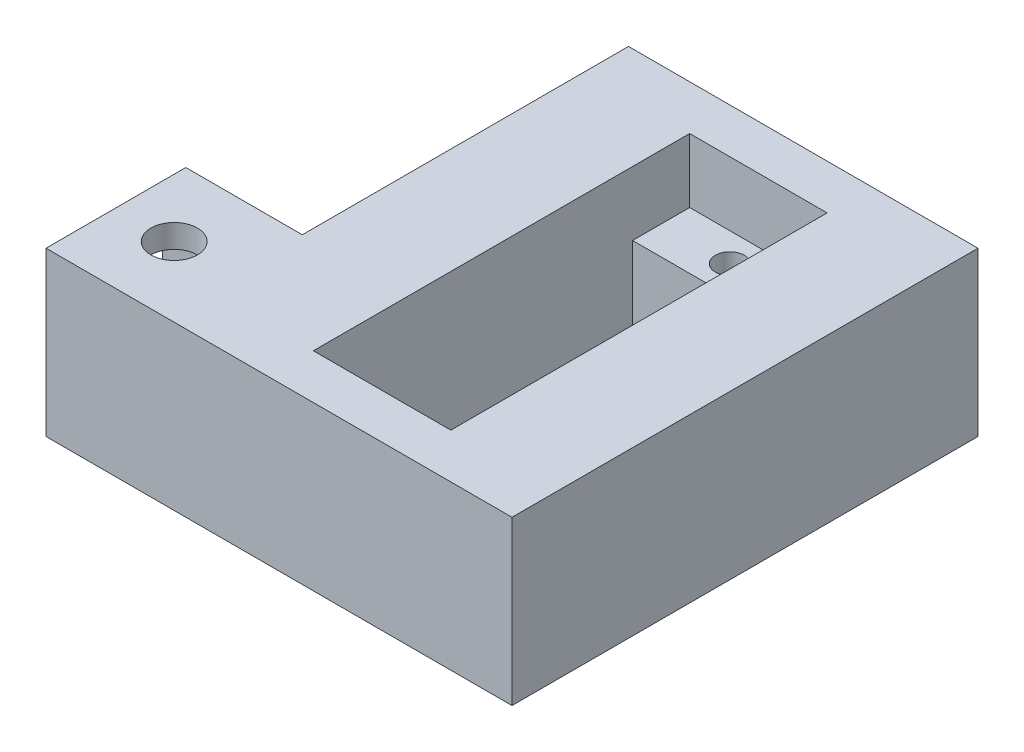
ISO-10303-21;
HEADER;
FILE_DESCRIPTION(('STEP AP214'),'2;1');
FILE_NAME('part.step','',(''),(''),'','','');
FILE_SCHEMA(('AUTOMOTIVE_DESIGN { 1 0 10303 214 1 1 1 1 }'));
ENDSEC;
DATA;
#1=APPLICATION_CONTEXT('core data for automotive mechanical design processes');
#2=APPLICATION_PROTOCOL_DEFINITION('international standard','automotive_design',2000,#1);
#3=PRODUCT_CONTEXT('',#1,'mechanical');
#4=PRODUCT('Part','Part','',(#3));
#5=PRODUCT_RELATED_PRODUCT_CATEGORY('part','',(#4));
#6=PRODUCT_DEFINITION_FORMATION('','',#4);
#7=PRODUCT_DEFINITION_CONTEXT('part definition',#1,'design');
#8=PRODUCT_DEFINITION('design','',#6,#7);
#9=PRODUCT_DEFINITION_SHAPE('','',#8);
#10=(LENGTH_UNIT() NAMED_UNIT(*) SI_UNIT(.MILLI.,.METRE.));
#11=(NAMED_UNIT(*) PLANE_ANGLE_UNIT() SI_UNIT($,.RADIAN.));
#12=(NAMED_UNIT(*) SI_UNIT($,.STERADIAN.) SOLID_ANGLE_UNIT());
#13=UNCERTAINTY_MEASURE_WITH_UNIT(LENGTH_MEASURE(1.E-05),#10,'distance_accuracy_value','');
#14=(GEOMETRIC_REPRESENTATION_CONTEXT(3) GLOBAL_UNCERTAINTY_ASSIGNED_CONTEXT((#13)) GLOBAL_UNIT_ASSIGNED_CONTEXT((#10,
#11,#12)) REPRESENTATION_CONTEXT('',''));
#15=CARTESIAN_POINT('',(0.,0.,0.));
#16=DIRECTION('',(0.,0.,1.));
#17=DIRECTION('',(1.,0.,0.));
#18=AXIS2_PLACEMENT_3D('',#15,#16,#17);
#19=CARTESIAN_POINT('',(-21.329047434942,9.00358715260278,40.));
#20=DIRECTION('',(1.,0.,0.));
#21=DIRECTION('',(0.,0.,-1.));
#22=AXIS2_PLACEMENT_3D('',#19,#20,#21);
#23=PLANE('',#22);
#24=DIRECTION('',(0.,-1.,0.));
#25=VECTOR('',#24,1.);
#26=CARTESIAN_POINT('',(-21.329047434942,9.00358715260278,28.));
#27=LINE('',#26,#25);
#28=CARTESIAN_POINT('',(-21.329047434942,9.00358715260278,28.));
#29=VERTEX_POINT('',#28);
#30=CARTESIAN_POINT('',(-21.329047434942,-4.99526108798895,28.));
#31=VERTEX_POINT('',#30);
#32=EDGE_CURVE('E66',#29,#31,#27,.T.);
#33=ORIENTED_EDGE('',*,*,#32,.F.);
#34=DIRECTION('',(0.,0.,-1.));
#35=VECTOR('',#34,1.);
#36=CARTESIAN_POINT('',(-21.329047434942,9.00358715260278,40.));
#37=LINE('',#36,#35);
#38=CARTESIAN_POINT('',(-21.329047434942,9.00358715260278,0.));
#39=VERTEX_POINT('',#38);
#40=EDGE_CURVE('E50',#29,#39,#37,.T.);
#41=ORIENTED_EDGE('',*,*,#40,.T.);
#42=DIRECTION('',(0.,-1.,0.));
#43=VECTOR('',#42,1.);
#44=CARTESIAN_POINT('',(-21.329047434942,9.00358715260278,0.));
#45=LINE('',#44,#43);
#46=CARTESIAN_POINT('',(-21.329047434942,-4.99526108798895,0.));
#47=VERTEX_POINT('',#46);
#48=EDGE_CURVE('E362',#39,#47,#45,.T.);
#49=ORIENTED_EDGE('',*,*,#48,.T.);
#50=DIRECTION('',(0.,0.,-1.));
#51=VECTOR('',#50,1.);
#52=CARTESIAN_POINT('',(-21.329047434942,-4.99526108798895,40.));
#53=LINE('',#52,#51);
#54=EDGE_CURVE('E371',#31,#47,#53,.T.);
#55=ORIENTED_EDGE('',*,*,#54,.F.);
#56=EDGE_LOOP('',(#33,#41,#49,#55));
#57=FACE_BOUND('',#56,.T.);
#58=ADVANCED_FACE('F40',(#57),#23,.F.);
#59=CARTESIAN_POINT('',(0.,3.50358715260278,0.));
#60=DIRECTION('',(0.,1.,0.));
#61=DIRECTION('',(0.,0.,1.));
#62=AXIS2_PLACEMENT_3D('',#59,#60,#61);
#63=PLANE('',#62);
#64=CARTESIAN_POINT('',(-6.32904743494199,3.50358715260278,33.7));
#65=DIRECTION('',(0.,1.,0.));
#66=DIRECTION('',(0.,0.,1.));
#67=AXIS2_PLACEMENT_3D('',#64,#65,#66);
#68=CIRCLE('',#67,1.25);
#69=CARTESIAN_POINT('',(-6.32904743494199,3.50358715260278,34.95));
#70=VERTEX_POINT('',#69);
#71=EDGE_CURVE('E245',#70,#70,#68,.T.);
#72=ORIENTED_EDGE('',*,*,#71,.F.);
#73=EDGE_LOOP('',(#72));
#74=FACE_BOUND('',#73,.T.);
#75=DIRECTION('',(1.,0.,0.));
#76=VECTOR('',#75,1.);
#77=CARTESIAN_POINT('',(-12.229047434942,3.50358715260278,31.25));
#78=LINE('',#77,#76);
#79=CARTESIAN_POINT('',(-12.229047434942,3.50358715260278,31.25));
#80=VERTEX_POINT('',#79);
#81=CARTESIAN_POINT('',(-0.429047434941994,3.50358715260278,31.25));
#82=VERTEX_POINT('',#81);
#83=EDGE_CURVE('E250',#80,#82,#78,.T.);
#84=ORIENTED_EDGE('',*,*,#83,.F.);
#85=DIRECTION('',(0.,0.,1.));
#86=VECTOR('',#85,1.);
#87=CARTESIAN_POINT('',(-12.229047434942,3.50358715260278,3.85));
#88=LINE('',#87,#86);
#89=CARTESIAN_POINT('',(-12.229047434942,3.50358715260278,36.15));
#90=VERTEX_POINT('',#89);
#91=EDGE_CURVE('E303',#80,#90,#88,.T.);
#92=ORIENTED_EDGE('',*,*,#91,.T.);
#93=DIRECTION('',(1.,0.,0.));
#94=VECTOR('',#93,1.);
#95=CARTESIAN_POINT('',(-12.229047434942,3.50358715260278,36.15));
#96=LINE('',#95,#94);
#97=CARTESIAN_POINT('',(-0.429047434941994,3.50358715260278,36.15));
#98=VERTEX_POINT('',#97);
#99=EDGE_CURVE('E302',#90,#98,#96,.T.);
#100=ORIENTED_EDGE('',*,*,#99,.T.);
#101=DIRECTION('',(0.,0.,-1.));
#102=VECTOR('',#101,1.);
#103=CARTESIAN_POINT('',(-0.429047434941994,3.50358715260278,3.85));
#104=LINE('',#103,#102);
#105=EDGE_CURVE('E308',#98,#82,#104,.T.);
#106=ORIENTED_EDGE('',*,*,#105,.T.);
#107=EDGE_LOOP('',(#84,#92,#100,#106));
#108=FACE_BOUND('',#107,.T.);
#109=ADVANCED_FACE('F401',(#74,#108),#63,.T.);
#110=CARTESIAN_POINT('',(8.67095256505801,9.00358715260278,40.));
#111=DIRECTION('',(1.,0.,0.));
#112=DIRECTION('',(0.,0.,-1.));
#113=AXIS2_PLACEMENT_3D('',#110,#111,#112);
#114=PLANE('',#113);
#115=DIRECTION('',(0.,-1.,0.));
#116=VECTOR('',#115,1.);
#117=CARTESIAN_POINT('',(8.67095256505801,9.00358715260278,0.));
#118=LINE('',#117,#116);
#119=CARTESIAN_POINT('',(8.67095256505801,9.00358715260278,0.));
#120=VERTEX_POINT('',#119);
#121=CARTESIAN_POINT('',(8.67095256505801,-4.99526108798895,0.));
#122=VERTEX_POINT('',#121);
#123=EDGE_CURVE('E334',#120,#122,#118,.T.);
#124=ORIENTED_EDGE('',*,*,#123,.F.);
#125=DIRECTION('',(0.,0.,-1.));
#126=VECTOR('',#125,1.);
#127=CARTESIAN_POINT('',(8.67095256505801,9.00358715260278,40.));
#128=LINE('',#127,#126);
#129=CARTESIAN_POINT('',(8.67095256505801,9.00358715260278,40.));
#130=VERTEX_POINT('',#129);
#131=EDGE_CURVE('E11',#130,#120,#128,.T.);
#132=ORIENTED_EDGE('',*,*,#131,.F.);
#133=DIRECTION('',(0.,-1.,0.));
#134=VECTOR('',#133,1.);
#135=CARTESIAN_POINT('',(8.67095256505801,9.00358715260278,40.));
#136=LINE('',#135,#134);
#137=CARTESIAN_POINT('',(8.67095256505801,-4.99526108798895,40.));
#138=VERTEX_POINT('',#137);
#139=EDGE_CURVE('E344',#130,#138,#136,.T.);
#140=ORIENTED_EDGE('',*,*,#139,.T.);
#141=DIRECTION('',(0.,0.,-1.));
#142=VECTOR('',#141,1.);
#143=CARTESIAN_POINT('',(8.67095256505801,-4.99526108798895,40.));
#144=LINE('',#143,#142);
#145=EDGE_CURVE('E355',#138,#122,#144,.T.);
#146=ORIENTED_EDGE('',*,*,#145,.T.);
#147=EDGE_LOOP('',(#124,#132,#140,#146));
#148=FACE_BOUND('',#147,.T.);
#149=ADVANCED_FACE('F42',(#148),#114,.T.);
#150=CARTESIAN_POINT('',(8.67095256505801,9.00358715260278,40.));
#151=DIRECTION('',(0.,-1.,0.));
#152=DIRECTION('',(0.,0.,-1.));
#153=AXIS2_PLACEMENT_3D('',#150,#151,#152);
#154=PLANE('',#153);
#155=CARTESIAN_POINT('',(-26.329047434942,9.00358715260278,34.));
#156=DIRECTION('',(0.,1.,0.));
#157=DIRECTION('',(0.,0.,1.));
#158=AXIS2_PLACEMENT_3D('',#155,#156,#157);
#159=CIRCLE('',#158,2.);
#160=CARTESIAN_POINT('',(-26.329047434942,9.00358715260278,36.));
#161=VERTEX_POINT('',#160);
#162=EDGE_CURVE('E668',#161,#161,#159,.T.);
#163=ORIENTED_EDGE('',*,*,#162,.F.);
#164=EDGE_LOOP('',(#163));
#165=FACE_BOUND('',#164,.T.);
#166=DIRECTION('',(1.,0.,0.));
#167=VECTOR('',#166,1.);
#168=CARTESIAN_POINT('',(-12.229047434942,9.00358715260278,36.15));
#169=LINE('',#168,#167);
#170=CARTESIAN_POINT('',(-12.229047434942,9.00358715260278,36.15));
#171=VERTEX_POINT('',#170);
#172=CARTESIAN_POINT('',(-0.429047434941994,9.00358715260278,36.15));
#173=VERTEX_POINT('',#172);
#174=EDGE_CURVE('E319',#171,#173,#169,.T.);
#175=ORIENTED_EDGE('',*,*,#174,.F.);
#176=DIRECTION('',(0.,0.,1.));
#177=VECTOR('',#176,1.);
#178=CARTESIAN_POINT('',(-12.229047434942,9.00358715260278,3.85));
#179=LINE('',#178,#177);
#180=CARTESIAN_POINT('',(-12.229047434942,9.00358715260278,3.85));
#181=VERTEX_POINT('',#180);
#182=EDGE_CURVE('E289',#181,#171,#179,.T.);
#183=ORIENTED_EDGE('',*,*,#182,.F.);
#184=DIRECTION('',(-1.,0.,0.));
#185=VECTOR('',#184,1.);
#186=CARTESIAN_POINT('',(-12.229047434942,9.00358715260278,3.85));
#187=LINE('',#186,#185);
#188=CARTESIAN_POINT('',(-0.429047434941994,9.00358715260278,3.85));
#189=VERTEX_POINT('',#188);
#190=EDGE_CURVE('E327',#189,#181,#187,.T.);
#191=ORIENTED_EDGE('',*,*,#190,.F.);
#192=DIRECTION('',(0.,0.,-1.));
#193=VECTOR('',#192,1.);
#194=CARTESIAN_POINT('',(-0.429047434941994,9.00358715260278,3.85));
#195=LINE('',#194,#193);
#196=EDGE_CURVE('E323',#173,#189,#195,.T.);
#197=ORIENTED_EDGE('',*,*,#196,.F.);
#198=EDGE_LOOP('',(#175,#183,#191,#197));
#199=FACE_BOUND('',#198,.T.);
#200=DIRECTION('',(-1.,0.,0.));
#201=VECTOR('',#200,1.);
#202=CARTESIAN_POINT('',(8.67095256505801,9.00358715260278,0.));
#203=LINE('',#202,#201);
#204=EDGE_CURVE('E349',#120,#39,#203,.T.);
#205=ORIENTED_EDGE('',*,*,#204,.T.);
#206=ORIENTED_EDGE('',*,*,#40,.F.);
#207=DIRECTION('',(1.,0.,0.));
#208=VECTOR('',#207,1.);
#209=CARTESIAN_POINT('',(-31.329047434942,9.00358715260278,28.));
#210=LINE('',#209,#208);
#211=CARTESIAN_POINT('',(-31.329047434942,9.00358715260278,28.));
#212=VERTEX_POINT('',#211);
#213=EDGE_CURVE('E241',#212,#29,#210,.T.);
#214=ORIENTED_EDGE('',*,*,#213,.F.);
#215=DIRECTION('',(0.,0.,-1.));
#216=VECTOR('',#215,1.);
#217=CARTESIAN_POINT('',(-31.329047434942,9.00358715260278,40.));
#218=LINE('',#217,#216);
#219=CARTESIAN_POINT('',(-31.329047434942,9.00358715260278,40.));
#220=VERTEX_POINT('',#219);
#221=EDGE_CURVE('E220',#220,#212,#218,.T.);
#222=ORIENTED_EDGE('',*,*,#221,.F.);
#223=DIRECTION('',(-1.,0.,0.));
#224=VECTOR('',#223,1.);
#225=CARTESIAN_POINT('',(-11.329047434942,9.00358715260278,40.));
#226=LINE('',#225,#224);
#227=EDGE_CURVE('E352',#130,#220,#226,.T.);
#228=ORIENTED_EDGE('',*,*,#227,.F.);
#229=ORIENTED_EDGE('',*,*,#131,.T.);
#230=EDGE_LOOP('',(#205,#206,#214,#222,#228,#229));
#231=FACE_BOUND('',#230,.T.);
#232=ADVANCED_FACE('F387',(#165,#199,#231),#154,.F.);
#233=CARTESIAN_POINT('',(-21.329047434942,-4.99526108798895,40.));
#234=DIRECTION('',(0.,1.,0.));
#235=DIRECTION('',(0.,0.,1.));
#236=AXIS2_PLACEMENT_3D('',#233,#234,#235);
#237=PLANE('',#236);
#238=CARTESIAN_POINT('',(-26.329047434942,-4.99526108798895,34.));
#239=DIRECTION('',(0.,1.,0.));
#240=DIRECTION('',(0.,0.,1.));
#241=AXIS2_PLACEMENT_3D('',#238,#239,#240);
#242=CIRCLE('',#241,2.);
#243=CARTESIAN_POINT('',(-26.329047434942,-4.99526108798895,36.));
#244=VERTEX_POINT('',#243);
#245=EDGE_CURVE('E422',#244,#244,#242,.T.);
#246=ORIENTED_EDGE('',*,*,#245,.T.);
#247=EDGE_LOOP('',(#246));
#248=FACE_BOUND('',#247,.T.);
#249=CARTESIAN_POINT('',(-6.329047434942,-4.99526108798895,6.3));
#250=DIRECTION('',(0.,1.,0.));
#251=DIRECTION('',(0.,0.,1.));
#252=AXIS2_PLACEMENT_3D('',#249,#250,#251);
#253=CIRCLE('',#252,1.25);
#254=CARTESIAN_POINT('',(-6.329047434942,-4.99526108798895,7.55));
#255=VERTEX_POINT('',#254);
#256=EDGE_CURVE('E246',#255,#255,#253,.T.);
#257=ORIENTED_EDGE('',*,*,#256,.T.);
#258=EDGE_LOOP('',(#257));
#259=FACE_BOUND('',#258,.T.);
#260=CARTESIAN_POINT('',(-6.32904743494199,-4.99526108798895,33.7));
#261=DIRECTION('',(0.,1.,0.));
#262=DIRECTION('',(0.,0.,1.));
#263=AXIS2_PLACEMENT_3D('',#260,#261,#262);
#264=CIRCLE('',#263,1.25);
#265=CARTESIAN_POINT('',(-6.32904743494199,-4.99526108798895,34.95));
#266=VERTEX_POINT('',#265);
#267=EDGE_CURVE('E255',#266,#266,#264,.T.);
#268=ORIENTED_EDGE('',*,*,#267,.T.);
#269=EDGE_LOOP('',(#268));
#270=FACE_BOUND('',#269,.T.);
#271=DIRECTION('',(-1.,0.,0.));
#272=VECTOR('',#271,1.);
#273=CARTESIAN_POINT('',(-12.229047434942,-4.99526108798895,8.75));
#274=LINE('',#273,#272);
#275=CARTESIAN_POINT('',(-0.429047434941994,-4.99526108798895,8.75));
#276=VERTEX_POINT('',#275);
#277=CARTESIAN_POINT('',(-12.229047434942,-4.99526108798895,8.75));
#278=VERTEX_POINT('',#277);
#279=EDGE_CURVE('E275',#276,#278,#274,.T.);
#280=ORIENTED_EDGE('',*,*,#279,.T.);
#281=DIRECTION('',(0.,0.,1.));
#282=VECTOR('',#281,1.);
#283=CARTESIAN_POINT('',(-12.229047434942,-4.99526108798895,8.75));
#284=LINE('',#283,#282);
#285=CARTESIAN_POINT('',(-12.229047434942,-4.99526108798895,31.25));
#286=VERTEX_POINT('',#285);
#287=EDGE_CURVE('E262',#278,#286,#284,.T.);
#288=ORIENTED_EDGE('',*,*,#287,.T.);
#289=DIRECTION('',(1.,0.,0.));
#290=VECTOR('',#289,1.);
#291=CARTESIAN_POINT('',(-12.229047434942,-4.99526108798895,31.25));
#292=LINE('',#291,#290);
#293=CARTESIAN_POINT('',(-0.429047434941994,-4.99526108798895,31.25));
#294=VERTEX_POINT('',#293);
#295=EDGE_CURVE('E266',#286,#294,#292,.T.);
#296=ORIENTED_EDGE('',*,*,#295,.T.);
#297=DIRECTION('',(0.,0.,-1.));
#298=VECTOR('',#297,1.);
#299=CARTESIAN_POINT('',(-0.429047434941994,-4.99526108798895,8.75));
#300=LINE('',#299,#298);
#301=EDGE_CURVE('E271',#294,#276,#300,.T.);
#302=ORIENTED_EDGE('',*,*,#301,.T.);
#303=EDGE_LOOP('',(#280,#288,#296,#302));
#304=FACE_BOUND('',#303,.T.);
#305=DIRECTION('',(1.,0.,0.));
#306=VECTOR('',#305,1.);
#307=CARTESIAN_POINT('',(-21.329047434942,-4.99526108798895,0.));
#308=LINE('',#307,#306);
#309=EDGE_CURVE('E359',#47,#122,#308,.T.);
#310=ORIENTED_EDGE('',*,*,#309,.T.);
#311=ORIENTED_EDGE('',*,*,#145,.F.);
#312=DIRECTION('',(1.,0.,0.));
#313=VECTOR('',#312,1.);
#314=CARTESIAN_POINT('',(-11.329047434942,-4.99526108798895,40.));
#315=LINE('',#314,#313);
#316=CARTESIAN_POINT('',(-31.329047434942,-4.99526108798895,40.));
#317=VERTEX_POINT('',#316);
#318=EDGE_CURVE('E348',#317,#138,#315,.T.);
#319=ORIENTED_EDGE('',*,*,#318,.F.);
#320=DIRECTION('',(0.,0.,1.));
#321=VECTOR('',#320,1.);
#322=CARTESIAN_POINT('',(-31.329047434942,-4.99526108798895,40.));
#323=LINE('',#322,#321);
#324=CARTESIAN_POINT('',(-31.329047434942,-4.99526108798895,28.));
#325=VERTEX_POINT('',#324);
#326=EDGE_CURVE('E227',#325,#317,#323,.T.);
#327=ORIENTED_EDGE('',*,*,#326,.F.);
#328=DIRECTION('',(1.,0.,0.));
#329=VECTOR('',#328,1.);
#330=CARTESIAN_POINT('',(-31.329047434942,-4.99526108798895,28.));
#331=LINE('',#330,#329);
#332=EDGE_CURVE('E235',#325,#31,#331,.T.);
#333=ORIENTED_EDGE('',*,*,#332,.T.);
#334=ORIENTED_EDGE('',*,*,#54,.T.);
#335=EDGE_LOOP('',(#310,#311,#319,#327,#333,#334));
#336=FACE_BOUND('',#335,.T.);
#337=ADVANCED_FACE('F394',(#248,#259,#270,#304,#336),#237,.F.);
#338=CARTESIAN_POINT('',(0.,0.,40.));
#339=DIRECTION('',(0.,0.,1.));
#340=DIRECTION('',(1.,0.,0.));
#341=AXIS2_PLACEMENT_3D('',#338,#339,#340);
#342=PLANE('',#341);
#343=ORIENTED_EDGE('',*,*,#139,.F.);
#344=ORIENTED_EDGE('',*,*,#227,.T.);
#345=DIRECTION('',(0.,1.,0.));
#346=VECTOR('',#345,1.);
#347=CARTESIAN_POINT('',(-31.329047434942,9.00358715260278,40.));
#348=LINE('',#347,#346);
#349=EDGE_CURVE('E231',#317,#220,#348,.T.);
#350=ORIENTED_EDGE('',*,*,#349,.F.);
#351=ORIENTED_EDGE('',*,*,#318,.T.);
#352=EDGE_LOOP('',(#343,#344,#350,#351));
#353=FACE_BOUND('',#352,.T.);
#354=ADVANCED_FACE('F391',(#353),#342,.T.);
#355=CARTESIAN_POINT('',(0.,0.,0.));
#356=DIRECTION('',(0.,0.,1.));
#357=DIRECTION('',(1.,0.,0.));
#358=AXIS2_PLACEMENT_3D('',#355,#356,#357);
#359=PLANE('',#358);
#360=ORIENTED_EDGE('',*,*,#123,.T.);
#361=ORIENTED_EDGE('',*,*,#309,.F.);
#362=ORIENTED_EDGE('',*,*,#48,.F.);
#363=ORIENTED_EDGE('',*,*,#204,.F.);
#364=EDGE_LOOP('',(#360,#361,#362,#363));
#365=FACE_BOUND('',#364,.T.);
#366=ADVANCED_FACE('F384',(#365),#359,.F.);
#367=CARTESIAN_POINT('',(-12.229047434942,3.50358715260278,3.85));
#368=DIRECTION('',(-1.,0.,0.));
#369=DIRECTION('',(0.,0.,1.));
#370=AXIS2_PLACEMENT_3D('',#367,#368,#369);
#371=PLANE('',#370);
#372=ORIENTED_EDGE('',*,*,#182,.T.);
#373=DIRECTION('',(0.,1.,0.));
#374=VECTOR('',#373,1.);
#375=CARTESIAN_POINT('',(-12.229047434942,3.50358715260278,36.15));
#376=LINE('',#375,#374);
#377=EDGE_CURVE('E316',#90,#171,#376,.T.);
#378=ORIENTED_EDGE('',*,*,#377,.F.);
#379=ORIENTED_EDGE('',*,*,#91,.F.);
#380=DIRECTION('',(0.,1.,0.));
#381=VECTOR('',#380,1.);
#382=CARTESIAN_POINT('',(-12.229047434942,-4.99526108798895,31.25));
#383=LINE('',#382,#381);
#384=EDGE_CURVE('E279',#286,#80,#383,.T.);
#385=ORIENTED_EDGE('',*,*,#384,.F.);
#386=ORIENTED_EDGE('',*,*,#287,.F.);
#387=DIRECTION('',(0.,1.,0.));
#388=VECTOR('',#387,1.);
#389=CARTESIAN_POINT('',(-12.229047434942,-4.99526108798895,8.75));
#390=LINE('',#389,#388);
#391=CARTESIAN_POINT('',(-12.229047434942,3.50358715260278,8.75));
#392=VERTEX_POINT('',#391);
#393=EDGE_CURVE('E286',#278,#392,#390,.T.);
#394=ORIENTED_EDGE('',*,*,#393,.T.);
#395=CARTESIAN_POINT('',(-12.229047434942,3.50358715260278,3.85));
#396=VERTEX_POINT('',#395);
#397=EDGE_CURVE('E298',#396,#392,#88,.T.);
#398=ORIENTED_EDGE('',*,*,#397,.F.);
#399=DIRECTION('',(0.,1.,0.));
#400=VECTOR('',#399,1.);
#401=CARTESIAN_POINT('',(-12.229047434942,3.50358715260278,3.85));
#402=LINE('',#401,#400);
#403=EDGE_CURVE('E331',#396,#181,#402,.T.);
#404=ORIENTED_EDGE('',*,*,#403,.T.);
#405=EDGE_LOOP('',(#372,#378,#379,#385,#386,#394,#398,#404));
#406=FACE_BOUND('',#405,.T.);
#407=ADVANCED_FACE('F434',(#406),#371,.F.);
#408=CARTESIAN_POINT('',(-12.229047434942,3.50358715260278,3.85));
#409=DIRECTION('',(0.,0.,-1.));
#410=DIRECTION('',(-1.,0.,0.));
#411=AXIS2_PLACEMENT_3D('',#408,#409,#410);
#412=PLANE('',#411);
#413=ORIENTED_EDGE('',*,*,#190,.T.);
#414=ORIENTED_EDGE('',*,*,#403,.F.);
#415=DIRECTION('',(-1.,0.,0.));
#416=VECTOR('',#415,1.);
#417=CARTESIAN_POINT('',(-12.229047434942,3.50358715260278,3.85));
#418=LINE('',#417,#416);
#419=CARTESIAN_POINT('',(-0.429047434941994,3.50358715260278,3.85));
#420=VERTEX_POINT('',#419);
#421=EDGE_CURVE('E312',#420,#396,#418,.T.);
#422=ORIENTED_EDGE('',*,*,#421,.F.);
#423=DIRECTION('',(0.,1.,0.));
#424=VECTOR('',#423,1.);
#425=CARTESIAN_POINT('',(-0.429047434941994,3.50358715260278,3.85));
#426=LINE('',#425,#424);
#427=EDGE_CURVE('E335',#420,#189,#426,.T.);
#428=ORIENTED_EDGE('',*,*,#427,.T.);
#429=EDGE_LOOP('',(#413,#414,#422,#428));
#430=FACE_BOUND('',#429,.T.);
#431=ADVANCED_FACE('F461',(#430),#412,.F.);
#432=CARTESIAN_POINT('',(-0.429047434941994,3.50358715260278,3.85));
#433=DIRECTION('',(1.,0.,0.));
#434=DIRECTION('',(0.,0.,-1.));
#435=AXIS2_PLACEMENT_3D('',#432,#433,#434);
#436=PLANE('',#435);
#437=ORIENTED_EDGE('',*,*,#196,.T.);
#438=ORIENTED_EDGE('',*,*,#427,.F.);
#439=CARTESIAN_POINT('',(-0.429047434941994,3.50358715260278,8.75));
#440=VERTEX_POINT('',#439);
#441=EDGE_CURVE('E307',#440,#420,#104,.T.);
#442=ORIENTED_EDGE('',*,*,#441,.F.);
#443=DIRECTION('',(0.,1.,0.));
#444=VECTOR('',#443,1.);
#445=CARTESIAN_POINT('',(-0.429047434941994,-4.99526108798895,8.75));
#446=LINE('',#445,#444);
#447=EDGE_CURVE('E290',#276,#440,#446,.T.);
#448=ORIENTED_EDGE('',*,*,#447,.F.);
#449=ORIENTED_EDGE('',*,*,#301,.F.);
#450=DIRECTION('',(0.,1.,0.));
#451=VECTOR('',#450,1.);
#452=CARTESIAN_POINT('',(-0.429047434941994,-4.99526108798895,31.25));
#453=LINE('',#452,#451);
#454=EDGE_CURVE('E293',#294,#82,#453,.T.);
#455=ORIENTED_EDGE('',*,*,#454,.T.);
#456=ORIENTED_EDGE('',*,*,#105,.F.);
#457=DIRECTION('',(0.,1.,0.));
#458=VECTOR('',#457,1.);
#459=CARTESIAN_POINT('',(-0.429047434941994,3.50358715260278,36.15));
#460=LINE('',#459,#458);
#461=EDGE_CURVE('E338',#98,#173,#460,.T.);
#462=ORIENTED_EDGE('',*,*,#461,.T.);
#463=EDGE_LOOP('',(#437,#438,#442,#448,#449,#455,#456,#462));
#464=FACE_BOUND('',#463,.T.);
#465=ADVANCED_FACE('F444',(#464),#436,.F.);
#466=CARTESIAN_POINT('',(-12.229047434942,3.50358715260278,36.15));
#467=DIRECTION('',(0.,0.,1.));
#468=DIRECTION('',(1.,0.,0.));
#469=AXIS2_PLACEMENT_3D('',#466,#467,#468);
#470=PLANE('',#469);
#471=ORIENTED_EDGE('',*,*,#174,.T.);
#472=ORIENTED_EDGE('',*,*,#461,.F.);
#473=ORIENTED_EDGE('',*,*,#99,.F.);
#474=ORIENTED_EDGE('',*,*,#377,.T.);
#475=EDGE_LOOP('',(#471,#472,#473,#474));
#476=FACE_BOUND('',#475,.T.);
#477=ADVANCED_FACE('F456',(#476),#470,.F.);
#478=CARTESIAN_POINT('',(-6.329047434942,3.50358715260278,6.3));
#479=DIRECTION('',(0.,1.,0.));
#480=DIRECTION('',(0.,0.,1.));
#481=AXIS2_PLACEMENT_3D('',#478,#479,#480);
#482=CIRCLE('',#481,1.25);
#483=CARTESIAN_POINT('',(-6.329047434942,3.50358715260278,7.55));
#484=VERTEX_POINT('',#483);
#485=EDGE_CURVE('E251',#484,#484,#482,.T.);
#486=ORIENTED_EDGE('',*,*,#485,.F.);
#487=EDGE_LOOP('',(#486));
#488=FACE_BOUND('',#487,.T.);
#489=DIRECTION('',(-1.,0.,0.));
#490=VECTOR('',#489,1.);
#491=CARTESIAN_POINT('',(-12.229047434942,3.50358715260278,8.75));
#492=LINE('',#491,#490);
#493=EDGE_CURVE('E267',#440,#392,#492,.T.);
#494=ORIENTED_EDGE('',*,*,#493,.F.);
#495=ORIENTED_EDGE('',*,*,#441,.T.);
#496=ORIENTED_EDGE('',*,*,#421,.T.);
#497=ORIENTED_EDGE('',*,*,#397,.T.);
#498=EDGE_LOOP('',(#494,#495,#496,#497));
#499=FACE_BOUND('',#498,.T.);
#500=ADVANCED_FACE('F408',(#488,#499),#63,.T.);
#501=CARTESIAN_POINT('',(-12.229047434942,-4.99526108798895,8.75));
#502=DIRECTION('',(0.,0.,-1.));
#503=DIRECTION('',(-1.,0.,0.));
#504=AXIS2_PLACEMENT_3D('',#501,#502,#503);
#505=PLANE('',#504);
#506=ORIENTED_EDGE('',*,*,#493,.T.);
#507=ORIENTED_EDGE('',*,*,#393,.F.);
#508=ORIENTED_EDGE('',*,*,#279,.F.);
#509=ORIENTED_EDGE('',*,*,#447,.T.);
#510=EDGE_LOOP('',(#506,#507,#508,#509));
#511=FACE_BOUND('',#510,.T.);
#512=ADVANCED_FACE('F430',(#511),#505,.F.);
#513=CARTESIAN_POINT('',(-12.229047434942,-4.99526108798895,31.25));
#514=DIRECTION('',(0.,0.,1.));
#515=DIRECTION('',(1.,0.,0.));
#516=AXIS2_PLACEMENT_3D('',#513,#514,#515);
#517=PLANE('',#516);
#518=ORIENTED_EDGE('',*,*,#83,.T.);
#519=ORIENTED_EDGE('',*,*,#454,.F.);
#520=ORIENTED_EDGE('',*,*,#295,.F.);
#521=ORIENTED_EDGE('',*,*,#384,.T.);
#522=EDGE_LOOP('',(#518,#519,#520,#521));
#523=FACE_BOUND('',#522,.T.);
#524=ADVANCED_FACE('F441',(#523),#517,.F.);
#525=CARTESIAN_POINT('',(-6.329047434942,-4.99526108798895,6.3));
#526=DIRECTION('',(0.,1.,0.));
#527=DIRECTION('',(0.,0.,1.));
#528=AXIS2_PLACEMENT_3D('',#525,#526,#527);
#529=CYLINDRICAL_SURFACE('',#528,1.25);
#530=ORIENTED_EDGE('',*,*,#256,.F.);
#531=EDGE_LOOP('',(#530));
#532=FACE_BOUND('',#531,.T.);
#533=ORIENTED_EDGE('',*,*,#485,.T.);
#534=EDGE_LOOP('',(#533));
#535=FACE_BOUND('',#534,.T.);
#536=ADVANCED_FACE('F535',(#532,#535),#529,.F.);
#537=CARTESIAN_POINT('',(-6.32904743494199,-4.99526108798895,33.7));
#538=DIRECTION('',(0.,1.,0.));
#539=DIRECTION('',(0.,0.,1.));
#540=AXIS2_PLACEMENT_3D('',#537,#538,#539);
#541=CYLINDRICAL_SURFACE('',#540,1.25);
#542=ORIENTED_EDGE('',*,*,#267,.F.);
#543=EDGE_LOOP('',(#542));
#544=FACE_BOUND('',#543,.T.);
#545=ORIENTED_EDGE('',*,*,#71,.T.);
#546=EDGE_LOOP('',(#545));
#547=FACE_BOUND('',#546,.T.);
#548=ADVANCED_FACE('F541',(#544,#547),#541,.F.);
#549=CARTESIAN_POINT('',(-31.329047434942,9.00358715260278,28.));
#550=DIRECTION('',(0.,0.,1.));
#551=DIRECTION('',(1.,0.,0.));
#552=AXIS2_PLACEMENT_3D('',#549,#550,#551);
#553=PLANE('',#552);
#554=ORIENTED_EDGE('',*,*,#32,.T.);
#555=ORIENTED_EDGE('',*,*,#332,.F.);
#556=DIRECTION('',(0.,-1.,0.));
#557=VECTOR('',#556,1.);
#558=CARTESIAN_POINT('',(-31.329047434942,9.00358715260278,28.));
#559=LINE('',#558,#557);
#560=EDGE_CURVE('E224',#212,#325,#559,.T.);
#561=ORIENTED_EDGE('',*,*,#560,.F.);
#562=ORIENTED_EDGE('',*,*,#213,.T.);
#563=EDGE_LOOP('',(#554,#555,#561,#562));
#564=FACE_BOUND('',#563,.T.);
#565=ADVANCED_FACE('F399',(#564),#553,.F.);
#566=CARTESIAN_POINT('',(-31.329047434942,0.,0.));
#567=DIRECTION('',(-1.,0.,0.));
#568=DIRECTION('',(0.,0.,1.));
#569=AXIS2_PLACEMENT_3D('',#566,#567,#568);
#570=PLANE('',#569);
#571=DIRECTION('',(0.,-1.,0.));
#572=VECTOR('',#571,1.);
#573=CARTESIAN_POINT('',(-31.329047434942,7.00358715260278,30.));
#574=LINE('',#573,#572);
#575=CARTESIAN_POINT('',(-31.329047434942,7.00358715260278,30.));
#576=VERTEX_POINT('',#575);
#577=CARTESIAN_POINT('',(-31.329047434942,-2.99526108798895,30.));
#578=VERTEX_POINT('',#577);
#579=EDGE_CURVE('E58',#576,#578,#574,.T.);
#580=ORIENTED_EDGE('',*,*,#579,.F.);
#581=DIRECTION('',(0.,0.,-1.));
#582=VECTOR('',#581,1.);
#583=CARTESIAN_POINT('',(-31.329047434942,7.00358715260278,30.));
#584=LINE('',#583,#582);
#585=CARTESIAN_POINT('',(-31.329047434942,7.00358715260278,38.));
#586=VERTEX_POINT('',#585);
#587=EDGE_CURVE('E190',#586,#576,#584,.T.);
#588=ORIENTED_EDGE('',*,*,#587,.F.);
#589=DIRECTION('',(0.,1.,0.));
#590=VECTOR('',#589,1.);
#591=CARTESIAN_POINT('',(-31.329047434942,7.00358715260278,38.));
#592=LINE('',#591,#590);
#593=CARTESIAN_POINT('',(-31.329047434942,-2.99526108798895,38.));
#594=VERTEX_POINT('',#593);
#595=EDGE_CURVE('E194',#594,#586,#592,.T.);
#596=ORIENTED_EDGE('',*,*,#595,.F.);
#597=DIRECTION('',(0.,0.,1.));
#598=VECTOR('',#597,1.);
#599=CARTESIAN_POINT('',(-31.329047434942,-2.99526108798895,30.));
#600=LINE('',#599,#598);
#601=EDGE_CURVE('E206',#578,#594,#600,.T.);
#602=ORIENTED_EDGE('',*,*,#601,.F.);
#603=EDGE_LOOP('',(#580,#588,#596,#602));
#604=FACE_BOUND('',#603,.T.);
#605=ORIENTED_EDGE('',*,*,#221,.T.);
#606=ORIENTED_EDGE('',*,*,#560,.T.);
#607=ORIENTED_EDGE('',*,*,#326,.T.);
#608=ORIENTED_EDGE('',*,*,#349,.T.);
#609=EDGE_LOOP('',(#605,#606,#607,#608));
#610=FACE_BOUND('',#609,.T.);
#611=ADVANCED_FACE('F396',(#604,#610),#570,.T.);
#612=CARTESIAN_POINT('',(-21.329047434942,7.00358715260278,30.));
#613=DIRECTION('',(0.,0.,-1.));
#614=DIRECTION('',(-1.,0.,0.));
#615=AXIS2_PLACEMENT_3D('',#612,#613,#614);
#616=PLANE('',#615);
#617=ORIENTED_EDGE('',*,*,#579,.T.);
#618=DIRECTION('',(-1.,0.,0.));
#619=VECTOR('',#618,1.);
#620=CARTESIAN_POINT('',(-21.329047434942,-2.99526108798895,30.));
#621=LINE('',#620,#619);
#622=CARTESIAN_POINT('',(-21.329047434942,-2.99526108798895,30.));
#623=VERTEX_POINT('',#622);
#624=EDGE_CURVE('E165',#623,#578,#621,.T.);
#625=ORIENTED_EDGE('',*,*,#624,.F.);
#626=DIRECTION('',(0.,-1.,0.));
#627=VECTOR('',#626,1.);
#628=CARTESIAN_POINT('',(-21.329047434942,7.00358715260278,30.));
#629=LINE('',#628,#627);
#630=CARTESIAN_POINT('',(-21.329047434942,7.00358715260278,30.));
#631=VERTEX_POINT('',#630);
#632=EDGE_CURVE('E169',#631,#623,#629,.T.);
#633=ORIENTED_EDGE('',*,*,#632,.F.);
#634=DIRECTION('',(-1.,0.,0.));
#635=VECTOR('',#634,1.);
#636=CARTESIAN_POINT('',(-21.329047434942,7.00358715260278,30.));
#637=LINE('',#636,#635);
#638=EDGE_CURVE('E212',#631,#576,#637,.T.);
#639=ORIENTED_EDGE('',*,*,#638,.T.);
#640=EDGE_LOOP('',(#617,#625,#633,#639));
#641=FACE_BOUND('',#640,.T.);
#642=ADVANCED_FACE('F167',(#641),#616,.F.);
#643=CARTESIAN_POINT('',(-21.329047434942,7.00358715260278,30.));
#644=DIRECTION('',(0.,1.,0.));
#645=DIRECTION('',(0.,0.,1.));
#646=AXIS2_PLACEMENT_3D('',#643,#644,#645);
#647=PLANE('',#646);
#648=CARTESIAN_POINT('',(-26.329047434942,7.00358715260278,34.));
#649=DIRECTION('',(0.,1.,0.));
#650=DIRECTION('',(0.,0.,1.));
#651=AXIS2_PLACEMENT_3D('',#648,#649,#650);
#652=CIRCLE('',#651,2.);
#653=CARTESIAN_POINT('',(-26.329047434942,7.00358715260278,36.));
#654=VERTEX_POINT('',#653);
#655=EDGE_CURVE('E197',#654,#654,#652,.T.);
#656=ORIENTED_EDGE('',*,*,#655,.T.);
#657=EDGE_LOOP('',(#656));
#658=FACE_BOUND('',#657,.T.);
#659=ORIENTED_EDGE('',*,*,#587,.T.);
#660=ORIENTED_EDGE('',*,*,#638,.F.);
#661=DIRECTION('',(0.,0.,-1.));
#662=VECTOR('',#661,1.);
#663=CARTESIAN_POINT('',(-21.329047434942,7.00358715260278,30.));
#664=LINE('',#663,#662);
#665=CARTESIAN_POINT('',(-21.329047434942,7.00358715260278,38.));
#666=VERTEX_POINT('',#665);
#667=EDGE_CURVE('E176',#666,#631,#664,.T.);
#668=ORIENTED_EDGE('',*,*,#667,.F.);
#669=DIRECTION('',(-1.,0.,0.));
#670=VECTOR('',#669,1.);
#671=CARTESIAN_POINT('',(-21.329047434942,7.00358715260278,38.));
#672=LINE('',#671,#670);
#673=EDGE_CURVE('E215',#666,#586,#672,.T.);
#674=ORIENTED_EDGE('',*,*,#673,.T.);
#675=EDGE_LOOP('',(#659,#660,#668,#674));
#676=FACE_BOUND('',#675,.T.);
#677=ADVANCED_FACE('F603',(#658,#676),#647,.F.);
#678=CARTESIAN_POINT('',(-21.329047434942,7.00358715260278,38.));
#679=DIRECTION('',(0.,0.,1.));
#680=DIRECTION('',(1.,0.,0.));
#681=AXIS2_PLACEMENT_3D('',#678,#679,#680);
#682=PLANE('',#681);
#683=ORIENTED_EDGE('',*,*,#595,.T.);
#684=ORIENTED_EDGE('',*,*,#673,.F.);
#685=DIRECTION('',(0.,1.,0.));
#686=VECTOR('',#685,1.);
#687=CARTESIAN_POINT('',(-21.329047434942,7.00358715260278,38.));
#688=LINE('',#687,#686);
#689=CARTESIAN_POINT('',(-21.329047434942,-2.99526108798895,38.));
#690=VERTEX_POINT('',#689);
#691=EDGE_CURVE('E185',#690,#666,#688,.T.);
#692=ORIENTED_EDGE('',*,*,#691,.F.);
#693=DIRECTION('',(-1.,0.,0.));
#694=VECTOR('',#693,1.);
#695=CARTESIAN_POINT('',(-21.329047434942,-2.99526108798895,38.));
#696=LINE('',#695,#694);
#697=EDGE_CURVE('E175',#690,#594,#696,.T.);
#698=ORIENTED_EDGE('',*,*,#697,.T.);
#699=EDGE_LOOP('',(#683,#684,#692,#698));
#700=FACE_BOUND('',#699,.T.);
#701=ADVANCED_FACE('F611',(#700),#682,.F.);
#702=CARTESIAN_POINT('',(-21.329047434942,-2.99526108798895,30.));
#703=DIRECTION('',(0.,-1.,0.));
#704=DIRECTION('',(0.,0.,-1.));
#705=AXIS2_PLACEMENT_3D('',#702,#703,#704);
#706=PLANE('',#705);
#707=CARTESIAN_POINT('',(-26.329047434942,-2.99526108798895,34.));
#708=DIRECTION('',(0.,-1.,0.));
#709=DIRECTION('',(0.,0.,-1.));
#710=AXIS2_PLACEMENT_3D('',#707,#708,#709);
#711=CIRCLE('',#710,2.);
#712=CARTESIAN_POINT('',(-26.329047434942,-2.99526108798895,32.));
#713=VERTEX_POINT('',#712);
#714=EDGE_CURVE('E44',#713,#713,#711,.T.);
#715=ORIENTED_EDGE('',*,*,#714,.T.);
#716=EDGE_LOOP('',(#715));
#717=FACE_BOUND('',#716,.T.);
#718=ORIENTED_EDGE('',*,*,#601,.T.);
#719=ORIENTED_EDGE('',*,*,#697,.F.);
#720=DIRECTION('',(0.,0.,1.));
#721=VECTOR('',#720,1.);
#722=CARTESIAN_POINT('',(-21.329047434942,-2.99526108798895,30.));
#723=LINE('',#722,#721);
#724=EDGE_CURVE('E179',#623,#690,#723,.T.);
#725=ORIENTED_EDGE('',*,*,#724,.F.);
#726=ORIENTED_EDGE('',*,*,#624,.T.);
#727=EDGE_LOOP('',(#718,#719,#725,#726));
#728=FACE_BOUND('',#727,.T.);
#729=ADVANCED_FACE('F180',(#717,#728),#706,.F.);
#730=CARTESIAN_POINT('',(-21.329047434942,0.,0.));
#731=DIRECTION('',(-1.,0.,0.));
#732=DIRECTION('',(0.,0.,1.));
#733=AXIS2_PLACEMENT_3D('',#730,#731,#732);
#734=PLANE('',#733);
#735=ORIENTED_EDGE('',*,*,#632,.T.);
#736=ORIENTED_EDGE('',*,*,#724,.T.);
#737=ORIENTED_EDGE('',*,*,#691,.T.);
#738=ORIENTED_EDGE('',*,*,#667,.T.);
#739=EDGE_LOOP('',(#735,#736,#737,#738));
#740=FACE_BOUND('',#739,.T.);
#741=ADVANCED_FACE('F187',(#740),#734,.T.);
#742=CARTESIAN_POINT('',(-26.329047434942,-4.99526108798895,34.));
#743=DIRECTION('',(0.,1.,0.));
#744=DIRECTION('',(0.,0.,1.));
#745=AXIS2_PLACEMENT_3D('',#742,#743,#744);
#746=CYLINDRICAL_SURFACE('',#745,2.);
#747=ORIENTED_EDGE('',*,*,#245,.F.);
#748=EDGE_LOOP('',(#747));
#749=FACE_BOUND('',#748,.T.);
#750=ORIENTED_EDGE('',*,*,#714,.F.);
#751=EDGE_LOOP('',(#750));
#752=FACE_BOUND('',#751,.T.);
#753=ADVANCED_FACE('F635',(#749,#752),#746,.F.);
#754=ORIENTED_EDGE('',*,*,#162,.T.);
#755=EDGE_LOOP('',(#754));
#756=FACE_BOUND('',#755,.T.);
#757=ORIENTED_EDGE('',*,*,#655,.F.);
#758=EDGE_LOOP('',(#757));
#759=FACE_BOUND('',#758,.T.);
#760=ADVANCED_FACE('F642',(#756,#759),#746,.F.);
#761=CLOSED_SHELL('',(#58,#109,#149,#232,#337,#354,#366,#407,#431,#465,#477,#500,#512,#524,#536,
#548,#565,#611,#642,#677,#701,#729,#741,#753,#760));
#762=MANIFOLD_SOLID_BREP('B2',#761);
#763=ADVANCED_BREP_SHAPE_REPRESENTATION('',(#18,#762),#14);
#764=SHAPE_DEFINITION_REPRESENTATION(#9,#763);
ENDSEC;
END-ISO-10303-21;
